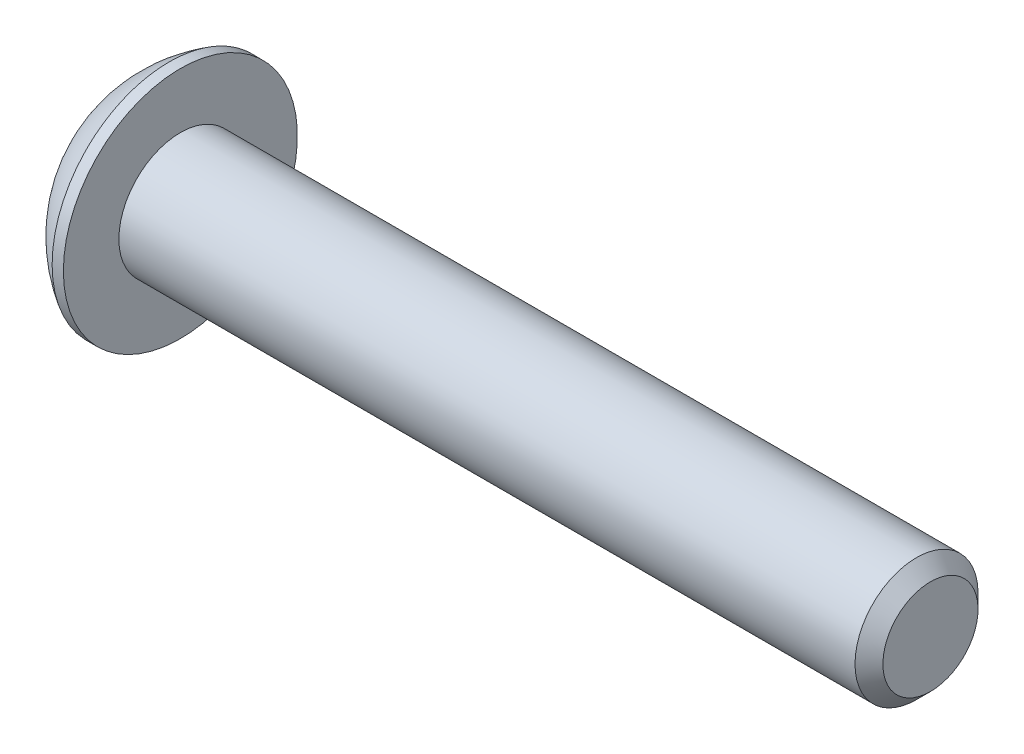
ISO-10303-21;
HEADER;
FILE_DESCRIPTION(('STEP AP214'),'2;1');
FILE_NAME('part.step','',(''),(''),'','','');
FILE_SCHEMA(('AUTOMOTIVE_DESIGN { 1 0 10303 214 1 1 1 1 }'));
ENDSEC;
DATA;
#1=APPLICATION_CONTEXT('core data for automotive mechanical design processes');
#2=APPLICATION_PROTOCOL_DEFINITION('international standard','automotive_design',2000,#1);
#3=PRODUCT_CONTEXT('',#1,'mechanical');
#4=PRODUCT('Part','Part','',(#3));
#5=PRODUCT_RELATED_PRODUCT_CATEGORY('part','',(#4));
#6=PRODUCT_DEFINITION_FORMATION('','',#4);
#7=PRODUCT_DEFINITION_CONTEXT('part definition',#1,'design');
#8=PRODUCT_DEFINITION('design','',#6,#7);
#9=PRODUCT_DEFINITION_SHAPE('','',#8);
#10=(LENGTH_UNIT() NAMED_UNIT(*) SI_UNIT(.MILLI.,.METRE.));
#11=(NAMED_UNIT(*) PLANE_ANGLE_UNIT() SI_UNIT($,.RADIAN.));
#12=(NAMED_UNIT(*) SI_UNIT($,.STERADIAN.) SOLID_ANGLE_UNIT());
#13=UNCERTAINTY_MEASURE_WITH_UNIT(LENGTH_MEASURE(1.E-05),#10,'distance_accuracy_value','');
#14=(GEOMETRIC_REPRESENTATION_CONTEXT(3) GLOBAL_UNCERTAINTY_ASSIGNED_CONTEXT((#13)) GLOBAL_UNIT_ASSIGNED_CONTEXT((#10,
#11,#12)) REPRESENTATION_CONTEXT('',''));
#15=CARTESIAN_POINT('',(0.,0.,0.));
#16=DIRECTION('',(0.,0.,1.));
#17=DIRECTION('',(1.,0.,0.));
#18=AXIS2_PLACEMENT_3D('',#15,#16,#17);
#19=CARTESIAN_POINT('',(1.32080000000034,0.,0.));
#20=DIRECTION('',(-1.,0.,0.));
#21=DIRECTION('',(0.,0.,1.));
#22=AXIS2_PLACEMENT_3D('',#19,#20,#21);
#23=CONICAL_SURFACE('',#22,1.1937999999998,1.04719755119608);
#24=CARTESIAN_POINT('',(2.01004075135902,0.,4.44089209850063E-13));
#25=VERTEX_POINT('',#24);
#26=VERTEX_LOOP('',#25);
#27=FACE_BOUND('',#26,.T.);
#28=CARTESIAN_POINT('',(1.32080000000009,0.,0.));
#29=DIRECTION('',(-1.,0.,0.));
#30=DIRECTION('',(0.,0.,1.));
#31=AXIS2_PLACEMENT_3D('',#28,#29,#30);
#32=CIRCLE('',#31,1.19380000000024);
#33=CARTESIAN_POINT('',(1.32080000000004,-1.03386112703797,0.59690000000006));
#34=VERTEX_POINT('',#33);
#35=CARTESIAN_POINT('',(1.32080000000004,0.,1.19380000000012));
#36=VERTEX_POINT('',#35);
#37=EDGE_CURVE('E19',#34,#36,#32,.T.);
#38=ORIENTED_EDGE('',*,*,#37,.T.);
#39=CARTESIAN_POINT('',(1.32080000000009,0.,0.));
#40=DIRECTION('',(-1.,0.,0.));
#41=DIRECTION('',(0.,0.,1.));
#42=AXIS2_PLACEMENT_3D('',#39,#40,#41);
#43=CIRCLE('',#42,1.19380000000024);
#44=CARTESIAN_POINT('',(1.32080000000004,1.03386112703797,0.596900000000061));
#45=VERTEX_POINT('',#44);
#46=EDGE_CURVE('E147',#36,#45,#43,.T.);
#47=ORIENTED_EDGE('',*,*,#46,.T.);
#48=CARTESIAN_POINT('',(1.32080000000009,0.,0.));
#49=DIRECTION('',(-1.,0.,0.));
#50=DIRECTION('',(0.,0.,1.));
#51=AXIS2_PLACEMENT_3D('',#48,#49,#50);
#52=CIRCLE('',#51,1.19380000000024);
#53=CARTESIAN_POINT('',(1.32080000000004,1.03386112703797,-0.596900000000061));
#54=VERTEX_POINT('',#53);
#55=EDGE_CURVE('E317',#45,#54,#52,.T.);
#56=ORIENTED_EDGE('',*,*,#55,.T.);
#57=CARTESIAN_POINT('',(1.32080000000009,0.,0.));
#58=DIRECTION('',(-1.,0.,0.));
#59=DIRECTION('',(0.,0.,1.));
#60=AXIS2_PLACEMENT_3D('',#57,#58,#59);
#61=CIRCLE('',#60,1.19380000000024);
#62=CARTESIAN_POINT('',(1.32080000000004,1.49457637585666E-12,-1.19380000000012));
#63=VERTEX_POINT('',#62);
#64=EDGE_CURVE('E318',#54,#63,#61,.T.);
#65=ORIENTED_EDGE('',*,*,#64,.T.);
#66=CARTESIAN_POINT('',(1.32080000000009,0.,0.));
#67=DIRECTION('',(-1.,0.,0.));
#68=DIRECTION('',(0.,0.,1.));
#69=AXIS2_PLACEMENT_3D('',#66,#67,#68);
#70=CIRCLE('',#69,1.19380000000024);
#71=CARTESIAN_POINT('',(1.32080000000004,-1.03386112703797,-0.59690000000006));
#72=VERTEX_POINT('',#71);
#73=EDGE_CURVE('E92',#63,#72,#70,.T.);
#74=ORIENTED_EDGE('',*,*,#73,.T.);
#75=CARTESIAN_POINT('',(1.32080000000009,0.,0.));
#76=DIRECTION('',(-1.,0.,0.));
#77=DIRECTION('',(0.,0.,1.));
#78=AXIS2_PLACEMENT_3D('',#75,#76,#77);
#79=CIRCLE('',#78,1.19380000000024);
#80=EDGE_CURVE('E88',#72,#34,#79,.T.);
#81=ORIENTED_EDGE('',*,*,#80,.T.);
#82=EDGE_LOOP('',(#38,#47,#56,#65,#74,#81));
#83=FACE_BOUND('',#82,.T.);
#84=ADVANCED_FACE('F16',(#27,#83),#23,.F.);
#85=CARTESIAN_POINT('',(1.3208,-2.06772225407572,-1.1938));
#86=DIRECTION('',(1.,0.,0.));
#87=DIRECTION('',(0.,0.,-1.));
#88=AXIS2_PLACEMENT_3D('',#85,#86,#87);
#89=PLANE('',#88);
#90=DIRECTION('',(0.,0.5,0.866025403784439));
#91=VECTOR('',#90,1.);
#92=CARTESIAN_POINT('',(1.3208,-1.37848150271715,0.));
#93=LINE('',#92,#91);
#94=CARTESIAN_POINT('',(1.3208,-0.689240751358574,1.1938));
#95=VERTEX_POINT('',#94);
#96=EDGE_CURVE('E100',#95,#34,#93,.F.);
#97=ORIENTED_EDGE('',*,*,#96,.F.);
#98=DIRECTION('',(0.,1.,0.));
#99=VECTOR('',#98,1.);
#100=CARTESIAN_POINT('',(1.3208,-0.689240751358574,1.1938));
#101=LINE('',#100,#99);
#102=EDGE_CURVE('E102',#36,#95,#101,.F.);
#103=ORIENTED_EDGE('',*,*,#102,.F.);
#104=ORIENTED_EDGE('',*,*,#37,.F.);
#105=EDGE_LOOP('',(#97,#103,#104));
#106=FACE_BOUND('',#105,.T.);
#107=ADVANCED_FACE('F98',(#106),#89,.F.);
#108=CARTESIAN_POINT('',(1.3208,-2.06772225407572,-1.1938));
#109=DIRECTION('',(1.,0.,0.));
#110=DIRECTION('',(0.,0.,-1.));
#111=AXIS2_PLACEMENT_3D('',#108,#109,#110);
#112=PLANE('',#111);
#113=DIRECTION('',(0.,-0.5,0.866025403784439));
#114=VECTOR('',#113,1.);
#115=CARTESIAN_POINT('',(1.3208,-0.689240751358574,-1.1938));
#116=LINE('',#115,#114);
#117=CARTESIAN_POINT('',(1.3208,-1.37848150271715,0.));
#118=VERTEX_POINT('',#117);
#119=EDGE_CURVE('E108',#118,#72,#116,.F.);
#120=ORIENTED_EDGE('',*,*,#119,.F.);
#121=DIRECTION('',(0.,0.5,0.866025403784439));
#122=VECTOR('',#121,1.);
#123=CARTESIAN_POINT('',(1.3208,-1.37848150271715,0.));
#124=LINE('',#123,#122);
#125=EDGE_CURVE('E105',#34,#118,#124,.F.);
#126=ORIENTED_EDGE('',*,*,#125,.F.);
#127=ORIENTED_EDGE('',*,*,#80,.F.);
#128=EDGE_LOOP('',(#120,#126,#127));
#129=FACE_BOUND('',#128,.T.);
#130=ADVANCED_FACE('F106',(#129),#112,.F.);
#131=CARTESIAN_POINT('',(1.3208,-2.06772225407572,-1.1938));
#132=DIRECTION('',(1.,0.,0.));
#133=DIRECTION('',(0.,0.,-1.));
#134=AXIS2_PLACEMENT_3D('',#131,#132,#133);
#135=PLANE('',#134);
#136=DIRECTION('',(0.,1.,0.));
#137=VECTOR('',#136,1.);
#138=CARTESIAN_POINT('',(1.3208,0.689240751358577,-1.1938));
#139=LINE('',#138,#137);
#140=CARTESIAN_POINT('',(1.3208,-0.689240751358574,-1.1938));
#141=VERTEX_POINT('',#140);
#142=EDGE_CURVE('E287',#141,#63,#139,.T.);
#143=ORIENTED_EDGE('',*,*,#142,.F.);
#144=DIRECTION('',(0.,-0.5,0.866025403784439));
#145=VECTOR('',#144,1.);
#146=CARTESIAN_POINT('',(1.3208,-0.689240751358574,-1.1938));
#147=LINE('',#146,#145);
#148=EDGE_CURVE('E299',#72,#141,#147,.F.);
#149=ORIENTED_EDGE('',*,*,#148,.F.);
#150=ORIENTED_EDGE('',*,*,#73,.F.);
#151=EDGE_LOOP('',(#143,#149,#150));
#152=FACE_BOUND('',#151,.T.);
#153=ADVANCED_FACE('F190',(#152),#135,.F.);
#154=CARTESIAN_POINT('',(1.3208,-2.06772225407572,-1.1938));
#155=DIRECTION('',(1.,0.,0.));
#156=DIRECTION('',(0.,0.,-1.));
#157=AXIS2_PLACEMENT_3D('',#154,#155,#156);
#158=PLANE('',#157);
#159=DIRECTION('',(0.,-0.5,-0.866025403784439));
#160=VECTOR('',#159,1.);
#161=CARTESIAN_POINT('',(1.3208,1.37848150271715,0.));
#162=LINE('',#161,#160);
#163=CARTESIAN_POINT('',(1.3208,0.689240751358577,-1.1938));
#164=VERTEX_POINT('',#163);
#165=EDGE_CURVE('E273',#164,#54,#162,.F.);
#166=ORIENTED_EDGE('',*,*,#165,.F.);
#167=DIRECTION('',(0.,1.,0.));
#168=VECTOR('',#167,1.);
#169=CARTESIAN_POINT('',(1.3208,0.689240751358577,-1.1938));
#170=LINE('',#169,#168);
#171=EDGE_CURVE('E284',#63,#164,#170,.T.);
#172=ORIENTED_EDGE('',*,*,#171,.F.);
#173=ORIENTED_EDGE('',*,*,#64,.F.);
#174=EDGE_LOOP('',(#166,#172,#173));
#175=FACE_BOUND('',#174,.T.);
#176=ADVANCED_FACE('F186',(#175),#158,.F.);
#177=CARTESIAN_POINT('',(1.3208,-2.06772225407572,-1.1938));
#178=DIRECTION('',(1.,0.,0.));
#179=DIRECTION('',(0.,0.,-1.));
#180=AXIS2_PLACEMENT_3D('',#177,#178,#179);
#181=PLANE('',#180);
#182=DIRECTION('',(0.,0.5,-0.866025403784439));
#183=VECTOR('',#182,1.);
#184=CARTESIAN_POINT('',(1.3208,0.689240751358576,1.1938));
#185=LINE('',#184,#183);
#186=CARTESIAN_POINT('',(1.3208,1.37848150271715,0.));
#187=VERTEX_POINT('',#186);
#188=EDGE_CURVE('E252',#187,#45,#185,.F.);
#189=ORIENTED_EDGE('',*,*,#188,.F.);
#190=DIRECTION('',(0.,-0.5,-0.866025403784439));
#191=VECTOR('',#190,1.);
#192=CARTESIAN_POINT('',(1.3208,1.37848150271715,0.));
#193=LINE('',#192,#191);
#194=EDGE_CURVE('E271',#54,#187,#193,.F.);
#195=ORIENTED_EDGE('',*,*,#194,.F.);
#196=ORIENTED_EDGE('',*,*,#55,.F.);
#197=EDGE_LOOP('',(#189,#195,#196));
#198=FACE_BOUND('',#197,.T.);
#199=ADVANCED_FACE('F182',(#198),#181,.F.);
#200=CARTESIAN_POINT('',(1.3208,-2.06772225407572,-1.1938));
#201=DIRECTION('',(1.,0.,0.));
#202=DIRECTION('',(0.,0.,-1.));
#203=AXIS2_PLACEMENT_3D('',#200,#201,#202);
#204=PLANE('',#203);
#205=DIRECTION('',(0.,1.,0.));
#206=VECTOR('',#205,1.);
#207=CARTESIAN_POINT('',(1.3208,-0.689240751358574,1.1938));
#208=LINE('',#207,#206);
#209=CARTESIAN_POINT('',(1.3208,0.689240751358576,1.1938));
#210=VERTEX_POINT('',#209);
#211=EDGE_CURVE('E117',#210,#36,#208,.F.);
#212=ORIENTED_EDGE('',*,*,#211,.F.);
#213=DIRECTION('',(0.,0.5,-0.866025403784439));
#214=VECTOR('',#213,1.);
#215=CARTESIAN_POINT('',(1.3208,0.689240751358576,1.1938));
#216=LINE('',#215,#214);
#217=EDGE_CURVE('E255',#45,#210,#216,.F.);
#218=ORIENTED_EDGE('',*,*,#217,.F.);
#219=ORIENTED_EDGE('',*,*,#46,.F.);
#220=EDGE_LOOP('',(#212,#218,#219));
#221=FACE_BOUND('',#220,.T.);
#222=ADVANCED_FACE('F178',(#221),#204,.F.);
#223=CARTESIAN_POINT('',(1.3208,-0.689240751358574,1.1938));
#224=DIRECTION('',(0.,0.,-1.));
#225=DIRECTION('',(0.,1.,0.));
#226=AXIS2_PLACEMENT_3D('',#223,#224,#225);
#227=PLANE('',#226);
#228=DIRECTION('',(0.,1.,0.));
#229=VECTOR('',#228,1.);
#230=CARTESIAN_POINT('',(0.,0.,1.1938));
#231=LINE('',#230,#229);
#232=CARTESIAN_POINT('',(0.,0.689240751358577,1.1938));
#233=VERTEX_POINT('',#232);
#234=CARTESIAN_POINT('',(0.,-0.689240751358574,1.1938));
#235=VERTEX_POINT('',#234);
#236=EDGE_CURVE('E249',#233,#235,#231,.F.);
#237=ORIENTED_EDGE('',*,*,#236,.F.);
#238=DIRECTION('',(1.,0.,0.));
#239=VECTOR('',#238,1.);
#240=CARTESIAN_POINT('',(1.3208,0.689240751358576,1.1938));
#241=LINE('',#240,#239);
#242=EDGE_CURVE('E261',#210,#233,#241,.F.);
#243=ORIENTED_EDGE('',*,*,#242,.F.);
#244=ORIENTED_EDGE('',*,*,#211,.T.);
#245=ORIENTED_EDGE('',*,*,#102,.T.);
#246=DIRECTION('',(1.,0.,0.));
#247=VECTOR('',#246,1.);
#248=CARTESIAN_POINT('',(1.3208,-0.689240751358574,1.1938));
#249=LINE('',#248,#247);
#250=EDGE_CURVE('E111',#235,#95,#249,.T.);
#251=ORIENTED_EDGE('',*,*,#250,.F.);
#252=EDGE_LOOP('',(#237,#243,#244,#245,#251));
#253=FACE_BOUND('',#252,.T.);
#254=ADVANCED_FACE('F175',(#253),#227,.T.);
#255=CARTESIAN_POINT('',(1.3208,-1.37848150271715,0.));
#256=DIRECTION('',(0.,0.866025403784439,-0.5));
#257=DIRECTION('',(0.,0.5,0.866025403784439));
#258=AXIS2_PLACEMENT_3D('',#255,#256,#257);
#259=PLANE('',#258);
#260=DIRECTION('',(0.,-0.5,-0.866025403784439));
#261=VECTOR('',#260,1.);
#262=CARTESIAN_POINT('',(0.,-0.689240751358574,1.1938));
#263=LINE('',#262,#261);
#264=CARTESIAN_POINT('',(0.,-1.37848150271715,0.));
#265=VERTEX_POINT('',#264);
#266=EDGE_CURVE('E246',#235,#265,#263,.T.);
#267=ORIENTED_EDGE('',*,*,#266,.F.);
#268=ORIENTED_EDGE('',*,*,#250,.T.);
#269=ORIENTED_EDGE('',*,*,#96,.T.);
#270=ORIENTED_EDGE('',*,*,#125,.T.);
#271=DIRECTION('',(1.,0.,0.));
#272=VECTOR('',#271,1.);
#273=CARTESIAN_POINT('',(1.3208,-1.37848150271715,0.));
#274=LINE('',#273,#272);
#275=EDGE_CURVE('E296',#265,#118,#274,.T.);
#276=ORIENTED_EDGE('',*,*,#275,.F.);
#277=EDGE_LOOP('',(#267,#268,#269,#270,#276));
#278=FACE_BOUND('',#277,.T.);
#279=ADVANCED_FACE('F115',(#278),#259,.T.);
#280=CARTESIAN_POINT('',(1.3208,-0.689240751358574,-1.1938));
#281=DIRECTION('',(0.,0.866025403784439,0.5));
#282=DIRECTION('',(0.,-0.5,0.866025403784439));
#283=AXIS2_PLACEMENT_3D('',#280,#281,#282);
#284=PLANE('',#283);
#285=DIRECTION('',(0.,0.5,-0.866025403784439));
#286=VECTOR('',#285,1.);
#287=CARTESIAN_POINT('',(0.,-1.37848150271715,0.));
#288=LINE('',#287,#286);
#289=CARTESIAN_POINT('',(0.,-0.689240751358574,-1.1938));
#290=VERTEX_POINT('',#289);
#291=EDGE_CURVE('E243',#265,#290,#288,.T.);
#292=ORIENTED_EDGE('',*,*,#291,.F.);
#293=ORIENTED_EDGE('',*,*,#275,.T.);
#294=ORIENTED_EDGE('',*,*,#119,.T.);
#295=ORIENTED_EDGE('',*,*,#148,.T.);
#296=DIRECTION('',(1.,0.,0.));
#297=VECTOR('',#296,1.);
#298=CARTESIAN_POINT('',(1.3208,-0.689240751358574,-1.1938));
#299=LINE('',#298,#297);
#300=EDGE_CURVE('E281',#290,#141,#299,.T.);
#301=ORIENTED_EDGE('',*,*,#300,.F.);
#302=EDGE_LOOP('',(#292,#293,#294,#295,#301));
#303=FACE_BOUND('',#302,.T.);
#304=ADVANCED_FACE('F168',(#303),#284,.T.);
#305=CARTESIAN_POINT('',(1.3208,0.689240751358577,-1.1938));
#306=DIRECTION('',(0.,0.,1.));
#307=DIRECTION('',(1.,0.,0.));
#308=AXIS2_PLACEMENT_3D('',#305,#306,#307);
#309=PLANE('',#308);
#310=DIRECTION('',(0.,1.,0.));
#311=VECTOR('',#310,1.);
#312=CARTESIAN_POINT('',(0.,0.,-1.1938));
#313=LINE('',#312,#311);
#314=CARTESIAN_POINT('',(0.,0.689240751358577,-1.1938));
#315=VERTEX_POINT('',#314);
#316=EDGE_CURVE('E240',#290,#315,#313,.T.);
#317=ORIENTED_EDGE('',*,*,#316,.F.);
#318=ORIENTED_EDGE('',*,*,#300,.T.);
#319=ORIENTED_EDGE('',*,*,#142,.T.);
#320=ORIENTED_EDGE('',*,*,#171,.T.);
#321=DIRECTION('',(1.,0.,0.));
#322=VECTOR('',#321,1.);
#323=CARTESIAN_POINT('',(1.3208,0.689240751358577,-1.1938));
#324=LINE('',#323,#322);
#325=EDGE_CURVE('E256',#315,#164,#324,.T.);
#326=ORIENTED_EDGE('',*,*,#325,.F.);
#327=EDGE_LOOP('',(#317,#318,#319,#320,#326));
#328=FACE_BOUND('',#327,.T.);
#329=ADVANCED_FACE('F165',(#328),#309,.T.);
#330=CARTESIAN_POINT('',(1.3208,1.37848150271715,0.));
#331=DIRECTION('',(0.,-0.866025403784439,0.5));
#332=DIRECTION('',(0.,-0.5,-0.866025403784439));
#333=AXIS2_PLACEMENT_3D('',#330,#331,#332);
#334=PLANE('',#333);
#335=DIRECTION('',(0.,0.5,0.866025403784439));
#336=VECTOR('',#335,1.);
#337=CARTESIAN_POINT('',(0.,0.689240751358577,-1.1938));
#338=LINE('',#337,#336);
#339=CARTESIAN_POINT('',(0.,1.37848150271715,0.));
#340=VERTEX_POINT('',#339);
#341=EDGE_CURVE('E237',#315,#340,#338,.T.);
#342=ORIENTED_EDGE('',*,*,#341,.F.);
#343=ORIENTED_EDGE('',*,*,#325,.T.);
#344=ORIENTED_EDGE('',*,*,#165,.T.);
#345=ORIENTED_EDGE('',*,*,#194,.T.);
#346=DIRECTION('',(1.,0.,0.));
#347=VECTOR('',#346,1.);
#348=CARTESIAN_POINT('',(1.3208,1.37848150271715,0.));
#349=LINE('',#348,#347);
#350=EDGE_CURVE('E34',#340,#187,#349,.T.);
#351=ORIENTED_EDGE('',*,*,#350,.F.);
#352=EDGE_LOOP('',(#342,#343,#344,#345,#351));
#353=FACE_BOUND('',#352,.T.);
#354=ADVANCED_FACE('F161',(#353),#334,.T.);
#355=CARTESIAN_POINT('',(1.3208,0.689240751358576,1.1938));
#356=DIRECTION('',(0.,-0.866025403784439,-0.5));
#357=DIRECTION('',(0.,0.5,-0.866025403784439));
#358=AXIS2_PLACEMENT_3D('',#355,#356,#357);
#359=PLANE('',#358);
#360=DIRECTION('',(0.,-0.5,0.866025403784439));
#361=VECTOR('',#360,1.);
#362=CARTESIAN_POINT('',(0.,1.37848150271715,0.));
#363=LINE('',#362,#361);
#364=EDGE_CURVE('E146',#340,#233,#363,.T.);
#365=ORIENTED_EDGE('',*,*,#364,.F.);
#366=ORIENTED_EDGE('',*,*,#350,.T.);
#367=ORIENTED_EDGE('',*,*,#188,.T.);
#368=ORIENTED_EDGE('',*,*,#217,.T.);
#369=ORIENTED_EDGE('',*,*,#242,.T.);
#370=EDGE_LOOP('',(#365,#366,#367,#368,#369));
#371=FACE_BOUND('',#370,.T.);
#372=ADVANCED_FACE('F157',(#371),#359,.T.);
#373=CARTESIAN_POINT('',(0.,0.,0.));
#374=DIRECTION('',(-1.,0.,0.));
#375=DIRECTION('',(0.,0.,1.));
#376=AXIS2_PLACEMENT_3D('',#373,#374,#375);
#377=PLANE('',#376);
#378=ORIENTED_EDGE('',*,*,#341,.T.);
#379=ORIENTED_EDGE('',*,*,#364,.T.);
#380=ORIENTED_EDGE('',*,*,#236,.T.);
#381=ORIENTED_EDGE('',*,*,#266,.T.);
#382=ORIENTED_EDGE('',*,*,#291,.T.);
#383=ORIENTED_EDGE('',*,*,#316,.T.);
#384=EDGE_LOOP('',(#378,#379,#380,#381,#382,#383));
#385=FACE_BOUND('',#384,.T.);
#386=CARTESIAN_POINT('',(0.,1.9812,0.));
#387=CARTESIAN_POINT('',(0.,1.9811996664299,0.0556258831179428));
#388=CARTESIAN_POINT('',(0.,1.97885520380442,0.111261989398606));
#389=CARTESIAN_POINT('',(0.,1.96949260169541,0.222149719830458));
#390=CARTESIAN_POINT('',(0.,1.96247308239605,0.277401225602895));
#391=CARTESIAN_POINT('',(0.,1.94379192841038,0.387209508139747));
#392=CARTESIAN_POINT('',(-1.85325793235264E-13,1.93212292489526,0.441765039546365));
#393=CARTESIAN_POINT('',(1.86344214223505E-13,1.90422331175315,0.549729449347493));
#394=CARTESIAN_POINT('',(6.94543371897454E-13,1.88798900035338,0.603137359208869));
#395=CARTESIAN_POINT('',(1.15501975216981E-12,1.83266214476501,0.760839131321828));
#396=CARTESIAN_POINT('',(0.,1.78690023648845,0.862876433575429));
#397=CARTESIAN_POINT('',(0.,1.67887358150667,1.05780719540872));
#398=CARTESIAN_POINT('',(9.54193214892627E-13,1.6166082074585,1.15070030720801));
#399=CARTESIAN_POINT('',(5.94805591894675E-13,1.51224157140982,1.28116890915697));
#400=CARTESIAN_POINT('',(1.63221293851378E-13,1.4755970394354,1.32320451127026));
#401=CARTESIAN_POINT('',(-1.62196980336157E-13,1.39893832619713,1.40400288695709));
#402=CARTESIAN_POINT('',(0.,1.35892742784698,1.44276877695455));
#403=CARTESIAN_POINT('',(1.14362537325405E-13,1.23416504602197,1.55382272417904));
#404=CARTESIAN_POINT('',(0.,1.14466125559859,1.62089527952111));
#405=CARTESIAN_POINT('',(0.,0.955712144178167,1.7390221808118));
#406=CARTESIAN_POINT('',(0.,0.856267198233564,1.79007713076007));
#407=CARTESIAN_POINT('',(0.,0.650206345910843,1.87477637530954));
#408=CARTESIAN_POINT('',(0.,0.543590516134855,1.90842085586267));
#409=CARTESIAN_POINT('',(0.,0.326226155292018,1.95733039300656));
#410=CARTESIAN_POINT('',(0.,0.21547760215793,1.97259535144288));
#411=CARTESIAN_POINT('',(0.,-0.00701040587544639,1.98431697865418));
#412=CARTESIAN_POINT('',(0.,-0.118749860774734,1.98077364742917));
#413=CARTESIAN_POINT('',(0.,-0.340050178355485,1.95497485623825));
#414=CARTESIAN_POINT('',(0.,-0.449611052668255,1.93271949620218));
#415=CARTESIAN_POINT('',(0.,-0.663431110729174,1.87014138774523));
#416=CARTESIAN_POINT('',(0.,-0.76769023783852,1.82981844635272));
#417=CARTESIAN_POINT('',(0.,-0.968005760719347,1.73219968377096));
#418=CARTESIAN_POINT('',(0.,-1.0640618469811,1.6749032225164));
#419=CARTESIAN_POINT('',(0.,-1.19980276751283,1.57757371205873));
#420=CARTESIAN_POINT('',(0.,-1.24366557129213,1.54322665019466));
#421=CARTESIAN_POINT('',(0.,-1.32838995706696,1.47093063174264));
#422=CARTESIAN_POINT('',(0.,-1.36924860178706,1.43297823102439));
#423=CARTESIAN_POINT('',(0.,-1.48674671849223,1.31419842051173));
#424=CARTESIAN_POINT('',(0.,-1.55842832343237,1.22836221289311));
#425=CARTESIAN_POINT('',(0.,-1.6863396856475,1.04586168272493));
#426=CARTESIAN_POINT('',(0.,-1.7425700302488,0.949197771949774));
#427=CARTESIAN_POINT('',(0.,-1.8141614250401,0.798182600298684));
#428=CARTESIAN_POINT('',(0.,-1.83591780585875,0.746776203847791));
#429=CARTESIAN_POINT('',(0.,-1.87500754181092,0.642341081688636));
#430=CARTESIAN_POINT('',(0.,-1.89234447645404,0.589313708122847));
#431=CARTESIAN_POINT('',(0.,-1.92246053433554,0.482076273028395));
#432=CARTESIAN_POINT('',(0.,-1.93524685475118,0.42786822425751));
#433=CARTESIAN_POINT('',(0.,-1.95620937250494,0.318578151844611));
#434=CARTESIAN_POINT('',(0.,-1.96438692958147,0.263496390912872));
#435=CARTESIAN_POINT('',(0.,-1.97388528284653,0.173607715038558));
#436=CARTESIAN_POINT('',(0.,-1.97662743364426,0.138944718024998));
#437=CARTESIAN_POINT('',(0.,-1.98028489645283,0.0695224782567002));
#438=CARTESIAN_POINT('',(0.,-1.98120020846367,0.0347632355019631));
#439=CARTESIAN_POINT('',(0.,-1.9811996664299,-0.0556258831179437));
#440=CARTESIAN_POINT('',(0.,-1.97885520380442,-0.111261989398607));
#441=CARTESIAN_POINT('',(0.,-1.96949260169541,-0.222149719830459));
#442=CARTESIAN_POINT('',(0.,-1.96247308239605,-0.277401225602897));
#443=CARTESIAN_POINT('',(0.,-1.94379192841039,-0.387209508139749));
#444=CARTESIAN_POINT('',(-1.85269749640691E-13,-1.93212292489526,-0.441765039546367));
#445=CARTESIAN_POINT('',(1.86288125054388E-13,-1.90422331175315,-0.549729449347495));
#446=CARTESIAN_POINT('',(6.94525090263764E-13,-1.88798900035338,-0.603137359208872));
#447=CARTESIAN_POINT('',(1.15505622829081E-12,-1.83266214476501,-0.760839131321831));
#448=CARTESIAN_POINT('',(0.,-1.78690023648845,-0.862876433575431));
#449=CARTESIAN_POINT('',(0.,-1.67887358150667,-1.05780719540872));
#450=CARTESIAN_POINT('',(9.54248812869379E-13,-1.6166082074585,-1.15070030720801));
#451=CARTESIAN_POINT('',(5.94777756479239E-13,-1.51224157140982,-1.28116890915698));
#452=CARTESIAN_POINT('',(1.63138949183833E-13,-1.47559703943539,-1.32320451127027));
#453=CARTESIAN_POINT('',(-1.62114715061273E-13,-1.39893832619713,-1.40400288695709));
#454=CARTESIAN_POINT('',(0.,-1.35892742784699,-1.44276877695455));
#455=CARTESIAN_POINT('',(1.13760489124207E-13,-1.23416504602197,-1.55382272417904));
#456=CARTESIAN_POINT('',(0.,-1.14466125559859,-1.62089527952111));
#457=CARTESIAN_POINT('',(0.,-0.95571214417816,-1.73902218081179));
#458=CARTESIAN_POINT('',(0.,-0.856267198233559,-1.79007713076007));
#459=CARTESIAN_POINT('',(0.,-0.650206345910841,-1.87477637530954));
#460=CARTESIAN_POINT('',(0.,-0.543590516134854,-1.90842085586267));
#461=CARTESIAN_POINT('',(0.,-0.326226155292018,-1.95733039300657));
#462=CARTESIAN_POINT('',(0.,-0.215477602157929,-1.97259535144288));
#463=CARTESIAN_POINT('',(0.,0.0070104058754487,-1.98431697865418));
#464=CARTESIAN_POINT('',(0.,0.118749860774737,-1.98077364742916));
#465=CARTESIAN_POINT('',(0.,0.340050178355489,-1.95497485623824));
#466=CARTESIAN_POINT('',(0.,0.44961105266826,-1.93271949620218));
#467=CARTESIAN_POINT('',(0.,0.663431110729178,-1.87014138774524));
#468=CARTESIAN_POINT('',(0.,0.767690237838524,-1.82981844635272));
#469=CARTESIAN_POINT('',(0.,0.968005760719348,-1.73219968377096));
#470=CARTESIAN_POINT('',(0.,1.0640618469811,-1.67490322251639));
#471=CARTESIAN_POINT('',(0.,1.19980276751283,-1.57757371205873));
#472=CARTESIAN_POINT('',(0.,1.24366557129214,-1.54322665019465));
#473=CARTESIAN_POINT('',(0.,1.32838995706696,-1.47093063174263));
#474=CARTESIAN_POINT('',(0.,1.36924860178706,-1.43297823102439));
#475=CARTESIAN_POINT('',(0.,1.48674671849223,-1.31419842051172));
#476=CARTESIAN_POINT('',(0.,1.55842832343237,-1.22836221289311));
#477=CARTESIAN_POINT('',(0.,1.6863396856475,-1.04586168272492));
#478=CARTESIAN_POINT('',(0.,1.7425700302488,-0.949197771949768));
#479=CARTESIAN_POINT('',(0.,1.8141614250401,-0.798182600298677));
#480=CARTESIAN_POINT('',(0.,1.83591780585875,-0.746776203847785));
#481=CARTESIAN_POINT('',(0.,1.87500754181092,-0.64234108168863));
#482=CARTESIAN_POINT('',(0.,1.89234447645404,-0.589313708122841));
#483=CARTESIAN_POINT('',(0.,1.92246053433555,-0.482076273028389));
#484=CARTESIAN_POINT('',(0.,1.93524685475118,-0.427868224257505));
#485=CARTESIAN_POINT('',(0.,1.95620937250494,-0.318578151844605));
#486=CARTESIAN_POINT('',(0.,1.96438692958147,-0.263496390912866));
#487=CARTESIAN_POINT('',(0.,1.97388528284653,-0.173607715038553));
#488=CARTESIAN_POINT('',(0.,1.97662743364426,-0.138944718024994));
#489=CARTESIAN_POINT('',(0.,1.98028489645283,-0.0695224782566989));
#490=CARTESIAN_POINT('',(0.,1.98120020846367,-0.034763235501963));
#491=CARTESIAN_POINT('',(0.,1.9812,0.));
#492=B_SPLINE_CURVE_WITH_KNOTS('',3,(#386,#387,#388,#389,#390,#391,#392,#393,#394,#395,#396,
#397,#398,#399,#400,#401,#402,#403,#404,#405,#406,#407,#408,#409,#410,#411,#412,#413,#414,#415,
#416,#417,#418,#419,#420,#421,#422,#423,#424,#425,#426,#427,#428,#429,#430,#431,#432,#433,#434,
#435,#436,#437,#438,#439,#440,#441,#442,#443,#444,#445,#446,#447,#448,#449,#450,#451,#452,#453,
#454,#455,#456,#457,#458,#459,#460,#461,#462,#463,#464,#465,#466,#467,#468,#469,#470,#471,#472,
#473,#474,#475,#476,#477,#478,#479,#480,#481,#482,#483,#484,#485,#486,#487,#488,#489,#490,#491),
.UNSPECIFIED.,.T.,.F.,(4,2,2,2,2,2,2,2,2,2,2,2,2,2,2,2,2,2,2,2,2,2,2,2,2,2,2,2,2,2,2,2,2,2,2,2,
2,2,2,2,2,2,2,2,2,2,2,2,2,2,2,2,4),(0.,0.166845646007828,0.333740557374255,0.500901034367693,
0.668197445942386,1.00199278686282,1.33580081809885,1.50292354032982,1.6698851310853,
2.00370118900129,2.33750465770544,2.67130456115909,3.005106247238,3.33890793331696,
3.67270783677065,4.00651130547476,4.34032736339026,4.50728895414554,4.67441167637632,
5.00821970761259,5.34201504853332,5.50931146010827,5.67647193710191,5.84336684846844,
6.0102124944764,6.11448220058334,6.21875190669029,6.38559755269812,6.55249246406454,
6.71965294105798,6.88694935263268,7.22074469355311,7.55455272478915,7.72167544702011,
7.88863703777559,8.22245309569158,8.55625656439573,8.89005646784938,9.2238581539283,
9.55765984000725,9.89145974346094,10.2252632121651,10.5590792700806,10.7260408608358,
10.8931635830666,11.2269716143029,11.5607669552236,11.7280633667986,11.8952238437922,
12.0621187551587,12.2289644011667,12.3332341072736,12.4375038133806),.UNSPECIFIED.);
#493=CARTESIAN_POINT('',(0.,1.9812,0.));
#494=VERTEX_POINT('',#493);
#495=EDGE_CURVE('E139',#494,#494,#492,.T.);
#496=ORIENTED_EDGE('',*,*,#495,.F.);
#497=EDGE_LOOP('',(#496));
#498=FACE_BOUND('',#497,.T.);
#499=ADVANCED_FACE('F153',(#385,#498),#377,.T.);
#500=CARTESIAN_POINT('',(4.13385,0.,0.));
#501=DIRECTION('',(0.,1.,0.));
#502=DIRECTION('',(1.,0.,0.));
#503=AXIS2_PLACEMENT_3D('',#500,#501,#502);
#504=SPHERICAL_SURFACE('',#503,4.58408870578439);
#505=CARTESIAN_POINT('',(1.8288,0.,0.));
#506=DIRECTION('',(-1.,0.,0.));
#507=DIRECTION('',(0.,0.,1.));
#508=AXIS2_PLACEMENT_3D('',#505,#506,#507);
#509=CIRCLE('',#508,3.9624);
#510=CARTESIAN_POINT('',(1.8288,0.,3.9624));
#511=VERTEX_POINT('',#510);
#512=EDGE_CURVE('E136',#511,#511,#509,.F.);
#513=ORIENTED_EDGE('',*,*,#512,.F.);
#514=EDGE_LOOP('',(#513));
#515=FACE_BOUND('',#514,.T.);
#516=ORIENTED_EDGE('',*,*,#495,.T.);
#517=EDGE_LOOP('',(#516));
#518=FACE_BOUND('',#517,.T.);
#519=ADVANCED_FACE('F149',(#515,#518),#504,.T.);
#520=CARTESIAN_POINT('',(27.6098,0.,0.));
#521=DIRECTION('',(-1.,0.,0.));
#522=DIRECTION('',(0.,0.,1.));
#523=AXIS2_PLACEMENT_3D('',#520,#521,#522);
#524=PLANE('',#523);
#525=CARTESIAN_POINT('',(27.6097999999365,0.,0.));
#526=DIRECTION('',(-1.,0.,0.));
#527=DIRECTION('',(0.,-1.,0.));
#528=AXIS2_PLACEMENT_3D('',#525,#526,#527);
#529=CIRCLE('',#528,1.61036000002923);
#530=CARTESIAN_POINT('',(27.6097999999365,-1.61036000002923,0.));
#531=VERTEX_POINT('',#530);
#532=EDGE_CURVE('E133',#531,#531,#529,.T.);
#533=ORIENTED_EDGE('',*,*,#532,.F.);
#534=EDGE_LOOP('',(#533));
#535=FACE_BOUND('',#534,.T.);
#536=ADVANCED_FACE('F221',(#535),#524,.F.);
#537=CARTESIAN_POINT('',(0.,0.,0.));
#538=DIRECTION('',(-1.,0.,0.));
#539=DIRECTION('',(0.,0.,1.));
#540=AXIS2_PLACEMENT_3D('',#537,#538,#539);
#541=CYLINDRICAL_SURFACE('',#540,3.9624);
#542=ORIENTED_EDGE('',*,*,#512,.T.);
#543=EDGE_LOOP('',(#542));
#544=FACE_BOUND('',#543,.T.);
#545=CARTESIAN_POINT('',(2.2098,0.,0.));
#546=DIRECTION('',(-1.,0.,0.));
#547=DIRECTION('',(0.,0.,1.));
#548=AXIS2_PLACEMENT_3D('',#545,#546,#547);
#549=CIRCLE('',#548,3.9624);
#550=CARTESIAN_POINT('',(2.2098,0.,3.9624));
#551=VERTEX_POINT('',#550);
#552=EDGE_CURVE('E130',#551,#551,#549,.T.);
#553=ORIENTED_EDGE('',*,*,#552,.T.);
#554=EDGE_LOOP('',(#553));
#555=FACE_BOUND('',#554,.T.);
#556=ADVANCED_FACE('F218',(#544,#555),#541,.T.);
#557=CARTESIAN_POINT('',(27.1373600000402,0.,0.));
#558=DIRECTION('',(-1.,0.,0.));
#559=DIRECTION('',(0.,-1.,0.));
#560=AXIS2_PLACEMENT_3D('',#557,#558,#559);
#561=CONICAL_SURFACE('',#560,2.08279999992556,0.785398163397448);
#562=ORIENTED_EDGE('',*,*,#532,.T.);
#563=EDGE_LOOP('',(#562));
#564=FACE_BOUND('',#563,.T.);
#565=CARTESIAN_POINT('',(27.13736,0.,0.));
#566=DIRECTION('',(-1.,0.,0.));
#567=DIRECTION('',(0.,0.,1.));
#568=AXIS2_PLACEMENT_3D('',#565,#566,#567);
#569=CIRCLE('',#568,2.0828);
#570=CARTESIAN_POINT('',(27.13736,0.,2.0828));
#571=VERTEX_POINT('',#570);
#572=EDGE_CURVE('E25',#571,#571,#569,.T.);
#573=ORIENTED_EDGE('',*,*,#572,.F.);
#574=EDGE_LOOP('',(#573));
#575=FACE_BOUND('',#574,.T.);
#576=ADVANCED_FACE('F210',(#564,#575),#561,.T.);
#577=CARTESIAN_POINT('',(2.2098,2.0828,0.));
#578=DIRECTION('',(-1.,0.,0.));
#579=DIRECTION('',(0.,0.,1.));
#580=AXIS2_PLACEMENT_3D('',#577,#578,#579);
#581=PLANE('',#580);
#582=CARTESIAN_POINT('',(2.2098,0.,0.));
#583=DIRECTION('',(-1.,0.,0.));
#584=DIRECTION('',(0.,0.,1.));
#585=AXIS2_PLACEMENT_3D('',#582,#583,#584);
#586=CIRCLE('',#585,2.0828);
#587=CARTESIAN_POINT('',(2.2098,0.,2.0828));
#588=VERTEX_POINT('',#587);
#589=EDGE_CURVE('E10',#588,#588,#586,.F.);
#590=ORIENTED_EDGE('',*,*,#589,.F.);
#591=EDGE_LOOP('',(#590));
#592=FACE_BOUND('',#591,.T.);
#593=ORIENTED_EDGE('',*,*,#552,.F.);
#594=EDGE_LOOP('',(#593));
#595=FACE_BOUND('',#594,.T.);
#596=ADVANCED_FACE('F204',(#592,#595),#581,.F.);
#597=CARTESIAN_POINT('',(0.,0.,0.));
#598=DIRECTION('',(-1.,0.,0.));
#599=DIRECTION('',(0.,0.,1.));
#600=AXIS2_PLACEMENT_3D('',#597,#598,#599);
#601=CYLINDRICAL_SURFACE('',#600,2.0828);
#602=ORIENTED_EDGE('',*,*,#572,.T.);
#603=EDGE_LOOP('',(#602));
#604=FACE_BOUND('',#603,.T.);
#605=ORIENTED_EDGE('',*,*,#589,.T.);
#606=EDGE_LOOP('',(#605));
#607=FACE_BOUND('',#606,.T.);
#608=ADVANCED_FACE('F202',(#604,#607),#601,.T.);
#609=CLOSED_SHELL('',(#84,#107,#130,#153,#176,#199,#222,#254,#279,#304,#329,#354,#372,#499,#519,
#536,#556,#576,#596,#608));
#610=MANIFOLD_SOLID_BREP('B1',#609);
#611=ADVANCED_BREP_SHAPE_REPRESENTATION('',(#18,#610),#14);
#612=SHAPE_DEFINITION_REPRESENTATION(#9,#611);
ENDSEC;
END-ISO-10303-21;
